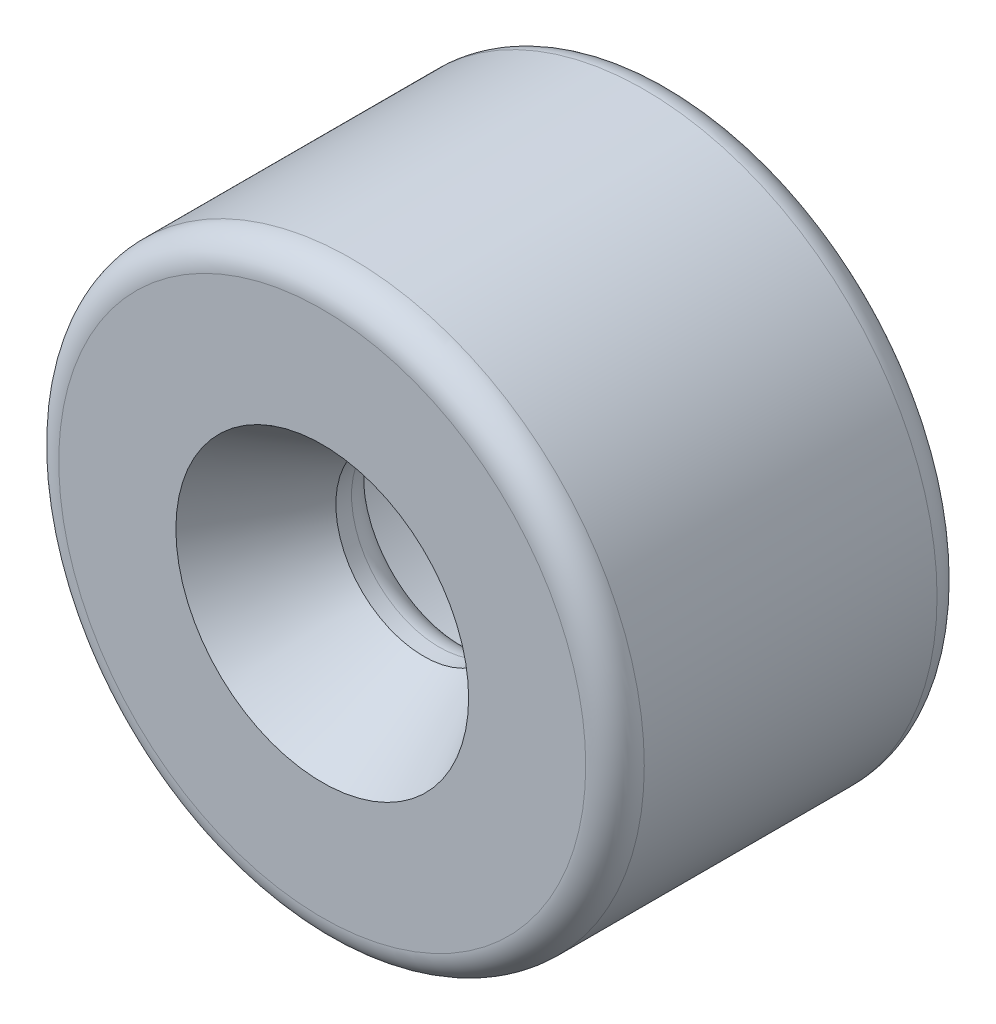
ISO-10303-21;
HEADER;
FILE_DESCRIPTION(('STEP AP214'),'2;1');
FILE_NAME('part.step','',(''),(''),'','','');
FILE_SCHEMA(('AUTOMOTIVE_DESIGN { 1 0 10303 214 1 1 1 1 }'));
ENDSEC;
DATA;
#1=APPLICATION_CONTEXT('core data for automotive mechanical design processes');
#2=APPLICATION_PROTOCOL_DEFINITION('international standard','automotive_design',2000,#1);
#3=PRODUCT_CONTEXT('',#1,'mechanical');
#4=PRODUCT('Part','Part','',(#3));
#5=PRODUCT_RELATED_PRODUCT_CATEGORY('part','',(#4));
#6=PRODUCT_DEFINITION_FORMATION('','',#4);
#7=PRODUCT_DEFINITION_CONTEXT('part definition',#1,'design');
#8=PRODUCT_DEFINITION('design','',#6,#7);
#9=PRODUCT_DEFINITION_SHAPE('','',#8);
#10=(LENGTH_UNIT() NAMED_UNIT(*) SI_UNIT(.MILLI.,.METRE.));
#11=(NAMED_UNIT(*) PLANE_ANGLE_UNIT() SI_UNIT($,.RADIAN.));
#12=(NAMED_UNIT(*) SI_UNIT($,.STERADIAN.) SOLID_ANGLE_UNIT());
#13=UNCERTAINTY_MEASURE_WITH_UNIT(LENGTH_MEASURE(1.E-05),#10,'distance_accuracy_value','');
#14=(GEOMETRIC_REPRESENTATION_CONTEXT(3) GLOBAL_UNCERTAINTY_ASSIGNED_CONTEXT((#13)) GLOBAL_UNIT_ASSIGNED_CONTEXT((#10,
#11,#12)) REPRESENTATION_CONTEXT('',''));
#15=CARTESIAN_POINT('',(0.,0.,0.));
#16=DIRECTION('',(0.,0.,1.));
#17=DIRECTION('',(1.,0.,0.));
#18=AXIS2_PLACEMENT_3D('',#15,#16,#17);
#19=CARTESIAN_POINT('',(0.,0.,6.));
#20=DIRECTION('',(0.,0.,1.));
#21=DIRECTION('',(1.,0.,0.));
#22=AXIS2_PLACEMENT_3D('',#19,#20,#21);
#23=PLANE('',#22);
#24=CARTESIAN_POINT('',(0.,0.,6.));
#25=DIRECTION('',(0.,0.,1.));
#26=DIRECTION('',(1.,0.,0.));
#27=AXIS2_PLACEMENT_3D('',#24,#25,#26);
#28=CIRCLE('',#27,2.5);
#29=CARTESIAN_POINT('',(2.5,0.,6.));
#30=VERTEX_POINT('',#29);
#31=EDGE_CURVE('E10',#30,#30,#28,.F.);
#32=ORIENTED_EDGE('',*,*,#31,.T.);
#33=EDGE_LOOP('',(#32));
#34=FACE_BOUND('',#33,.T.);
#35=CARTESIAN_POINT('',(0.,0.,6.));
#36=DIRECTION('',(0.,0.,1.));
#37=DIRECTION('',(1.,0.,0.));
#38=AXIS2_PLACEMENT_3D('',#35,#36,#37);
#39=CIRCLE('',#38,4.5);
#40=CARTESIAN_POINT('',(4.5,0.,6.));
#41=VERTEX_POINT('',#40);
#42=EDGE_CURVE('E53',#41,#41,#39,.T.);
#43=ORIENTED_EDGE('',*,*,#42,.T.);
#44=EDGE_LOOP('',(#43));
#45=FACE_BOUND('',#44,.T.);
#46=ADVANCED_FACE('F39',(#34,#45),#23,.T.);
#47=CARTESIAN_POINT('',(0.,0.,0.));
#48=DIRECTION('',(0.,0.,1.));
#49=DIRECTION('',(1.,0.,0.));
#50=AXIS2_PLACEMENT_3D('',#47,#48,#49);
#51=PLANE('',#50);
#52=CARTESIAN_POINT('',(0.,0.,0.));
#53=DIRECTION('',(0.,0.,1.));
#54=DIRECTION('',(1.,0.,0.));
#55=AXIS2_PLACEMENT_3D('',#52,#53,#54);
#56=CIRCLE('',#55,4.5);
#57=CARTESIAN_POINT('',(4.5,0.,0.));
#58=VERTEX_POINT('',#57);
#59=EDGE_CURVE('E72',#58,#58,#56,.F.);
#60=ORIENTED_EDGE('',*,*,#59,.T.);
#61=EDGE_LOOP('',(#60));
#62=FACE_BOUND('',#61,.T.);
#63=CARTESIAN_POINT('',(0.,0.,0.));
#64=DIRECTION('',(0.,0.,1.));
#65=DIRECTION('',(1.,0.,0.));
#66=AXIS2_PLACEMENT_3D('',#63,#64,#65);
#67=CIRCLE('',#66,4.25);
#68=CARTESIAN_POINT('',(4.25,0.,0.));
#69=VERTEX_POINT('',#68);
#70=EDGE_CURVE('E76',#69,#69,#67,.T.);
#71=ORIENTED_EDGE('',*,*,#70,.T.);
#72=EDGE_LOOP('',(#71));
#73=FACE_BOUND('',#72,.T.);
#74=ADVANCED_FACE('F111',(#62,#73),#51,.F.);
#75=CARTESIAN_POINT('',(0.,0.,6.));
#76=DIRECTION('',(0.,0.,-1.));
#77=DIRECTION('',(-1.,0.,0.));
#78=AXIS2_PLACEMENT_3D('',#75,#76,#77);
#79=CYLINDRICAL_SURFACE('',#78,5.);
#80=CARTESIAN_POINT('',(0.,0.,0.5));
#81=DIRECTION('',(0.,0.,1.));
#82=DIRECTION('',(1.,0.,0.));
#83=AXIS2_PLACEMENT_3D('',#80,#81,#82);
#84=CIRCLE('',#83,5.);
#85=CARTESIAN_POINT('',(5.,0.,0.5));
#86=VERTEX_POINT('',#85);
#87=EDGE_CURVE('E80',#86,#86,#84,.T.);
#88=ORIENTED_EDGE('',*,*,#87,.T.);
#89=EDGE_LOOP('',(#88));
#90=FACE_BOUND('',#89,.T.);
#91=CARTESIAN_POINT('',(0.,0.,5.5));
#92=DIRECTION('',(0.,0.,1.));
#93=DIRECTION('',(1.,0.,0.));
#94=AXIS2_PLACEMENT_3D('',#91,#92,#93);
#95=CIRCLE('',#94,5.);
#96=CARTESIAN_POINT('',(5.,0.,5.5));
#97=VERTEX_POINT('',#96);
#98=EDGE_CURVE('E84',#97,#97,#95,.F.);
#99=ORIENTED_EDGE('',*,*,#98,.T.);
#100=EDGE_LOOP('',(#99));
#101=FACE_BOUND('',#100,.T.);
#102=ADVANCED_FACE('F116',(#90,#101),#79,.T.);
#103=CARTESIAN_POINT('',(0.,0.,6.));
#104=DIRECTION('',(0.,0.,-1.));
#105=DIRECTION('',(-1.,0.,0.));
#106=AXIS2_PLACEMENT_3D('',#103,#104,#105);
#107=CYLINDRICAL_SURFACE('',#106,1.5);
#108=CARTESIAN_POINT('',(0.,0.,4.26794919243113));
#109=DIRECTION('',(0.,0.,1.));
#110=DIRECTION('',(1.,0.,0.));
#111=AXIS2_PLACEMENT_3D('',#108,#109,#110);
#112=CIRCLE('',#111,1.5);
#113=CARTESIAN_POINT('',(1.5,0.,4.26794919243113));
#114=VERTEX_POINT('',#113);
#115=EDGE_CURVE('E48',#114,#114,#112,.T.);
#116=ORIENTED_EDGE('',*,*,#115,.T.);
#117=EDGE_LOOP('',(#116));
#118=FACE_BOUND('',#117,.T.);
#119=CARTESIAN_POINT('',(0.,0.,4.));
#120=DIRECTION('',(0.,0.,1.));
#121=DIRECTION('',(1.,0.,0.));
#122=AXIS2_PLACEMENT_3D('',#119,#120,#121);
#123=CIRCLE('',#122,1.5);
#124=CARTESIAN_POINT('',(1.5,0.,4.));
#125=VERTEX_POINT('',#124);
#126=EDGE_CURVE('E58',#125,#125,#123,.F.);
#127=ORIENTED_EDGE('',*,*,#126,.T.);
#128=EDGE_LOOP('',(#127));
#129=FACE_BOUND('',#128,.T.);
#130=ADVANCED_FACE('F107',(#118,#129),#107,.F.);
#131=CARTESIAN_POINT('',(0.,0.,3.5));
#132=DIRECTION('',(0.,0.,-1.));
#133=DIRECTION('',(-1.,0.,0.));
#134=AXIS2_PLACEMENT_3D('',#131,#132,#133);
#135=CYLINDRICAL_SURFACE('',#134,3.75);
#136=CARTESIAN_POINT('',(0.,0.,0.5));
#137=DIRECTION('',(0.,0.,1.));
#138=DIRECTION('',(1.,0.,0.));
#139=AXIS2_PLACEMENT_3D('',#136,#137,#138);
#140=CIRCLE('',#139,3.75);
#141=CARTESIAN_POINT('',(3.75,0.,0.5));
#142=VERTEX_POINT('',#141);
#143=EDGE_CURVE('E68',#142,#142,#140,.F.);
#144=ORIENTED_EDGE('',*,*,#143,.T.);
#145=EDGE_LOOP('',(#144));
#146=FACE_BOUND('',#145,.T.);
#147=CARTESIAN_POINT('',(0.,0.,3.5));
#148=DIRECTION('',(0.,0.,1.));
#149=DIRECTION('',(1.,0.,0.));
#150=AXIS2_PLACEMENT_3D('',#147,#148,#149);
#151=CIRCLE('',#150,3.75);
#152=CARTESIAN_POINT('',(3.75,0.,3.5));
#153=VERTEX_POINT('',#152);
#154=EDGE_CURVE('E88',#153,#153,#151,.T.);
#155=ORIENTED_EDGE('',*,*,#154,.T.);
#156=EDGE_LOOP('',(#155));
#157=FACE_BOUND('',#156,.T.);
#158=ADVANCED_FACE('F93',(#146,#157),#135,.F.);
#159=CARTESIAN_POINT('',(0.,0.,3.5));
#160=DIRECTION('',(0.,0.,1.));
#161=DIRECTION('',(1.,0.,0.));
#162=AXIS2_PLACEMENT_3D('',#159,#160,#161);
#163=PLANE('',#162);
#164=CARTESIAN_POINT('',(0.,0.,3.5));
#165=DIRECTION('',(0.,0.,1.));
#166=DIRECTION('',(1.,0.,0.));
#167=AXIS2_PLACEMENT_3D('',#164,#165,#166);
#168=CIRCLE('',#167,2.);
#169=CARTESIAN_POINT('',(2.,0.,3.5));
#170=VERTEX_POINT('',#169);
#171=EDGE_CURVE('E64',#170,#170,#168,.T.);
#172=ORIENTED_EDGE('',*,*,#171,.T.);
#173=EDGE_LOOP('',(#172));
#174=FACE_BOUND('',#173,.T.);
#175=ORIENTED_EDGE('',*,*,#154,.F.);
#176=EDGE_LOOP('',(#175));
#177=FACE_BOUND('',#176,.T.);
#178=ADVANCED_FACE('F95',(#174,#177),#163,.F.);
#179=CARTESIAN_POINT('',(0.,0.,0.5));
#180=DIRECTION('',(0.,0.,1.));
#181=DIRECTION('',(1.,0.,0.));
#182=AXIS2_PLACEMENT_3D('',#179,#180,#181);
#183=TOROIDAL_SURFACE('',#182,4.5,0.5);
#184=ORIENTED_EDGE('',*,*,#59,.F.);
#185=EDGE_LOOP('',(#184));
#186=FACE_BOUND('',#185,.T.);
#187=ORIENTED_EDGE('',*,*,#87,.F.);
#188=EDGE_LOOP('',(#187));
#189=FACE_BOUND('',#188,.T.);
#190=ADVANCED_FACE('F97',(#186,#189),#183,.T.);
#191=CARTESIAN_POINT('',(0.,0.,0.5));
#192=DIRECTION('',(0.,0.,1.));
#193=DIRECTION('',(1.,0.,0.));
#194=AXIS2_PLACEMENT_3D('',#191,#192,#193);
#195=TOROIDAL_SURFACE('',#194,4.25,0.5);
#196=ORIENTED_EDGE('',*,*,#143,.F.);
#197=EDGE_LOOP('',(#196));
#198=FACE_BOUND('',#197,.T.);
#199=ORIENTED_EDGE('',*,*,#70,.F.);
#200=EDGE_LOOP('',(#199));
#201=FACE_BOUND('',#200,.T.);
#202=ADVANCED_FACE('F104',(#198,#201),#195,.T.);
#203=CARTESIAN_POINT('',(0.,0.,4.));
#204=DIRECTION('',(0.,0.,1.));
#205=DIRECTION('',(1.,0.,0.));
#206=AXIS2_PLACEMENT_3D('',#203,#204,#205);
#207=TOROIDAL_SURFACE('',#206,2.,0.5);
#208=ORIENTED_EDGE('',*,*,#126,.F.);
#209=EDGE_LOOP('',(#208));
#210=FACE_BOUND('',#209,.T.);
#211=ORIENTED_EDGE('',*,*,#171,.F.);
#212=EDGE_LOOP('',(#211));
#213=FACE_BOUND('',#212,.T.);
#214=ADVANCED_FACE('F127',(#210,#213),#207,.T.);
#215=CARTESIAN_POINT('',(0.,0.,5.5));
#216=DIRECTION('',(0.,0.,1.));
#217=DIRECTION('',(1.,0.,0.));
#218=AXIS2_PLACEMENT_3D('',#215,#216,#217);
#219=TOROIDAL_SURFACE('',#218,4.5,0.5);
#220=ORIENTED_EDGE('',*,*,#98,.F.);
#221=EDGE_LOOP('',(#220));
#222=FACE_BOUND('',#221,.T.);
#223=ORIENTED_EDGE('',*,*,#42,.F.);
#224=EDGE_LOOP('',(#223));
#225=FACE_BOUND('',#224,.T.);
#226=ADVANCED_FACE('F130',(#222,#225),#219,.T.);
#227=CARTESIAN_POINT('',(0.,0.,4.26794919243113));
#228=DIRECTION('',(0.,0.,1.));
#229=DIRECTION('',(1.,0.,0.));
#230=AXIS2_PLACEMENT_3D('',#227,#228,#229);
#231=CONICAL_SURFACE('',#230,1.5,0.5235987755983);
#232=ORIENTED_EDGE('',*,*,#31,.F.);
#233=EDGE_LOOP('',(#232));
#234=FACE_BOUND('',#233,.T.);
#235=ORIENTED_EDGE('',*,*,#115,.F.);
#236=EDGE_LOOP('',(#235));
#237=FACE_BOUND('',#236,.T.);
#238=ADVANCED_FACE('F42',(#234,#237),#231,.F.);
#239=CLOSED_SHELL('',(#46,#74,#102,#130,#158,#178,#190,#202,#214,#226,#238));
#240=MANIFOLD_SOLID_BREP('B2',#239);
#241=ADVANCED_BREP_SHAPE_REPRESENTATION('',(#18,#240),#14);
#242=SHAPE_DEFINITION_REPRESENTATION(#9,#241);
ENDSEC;
END-ISO-10303-21;
